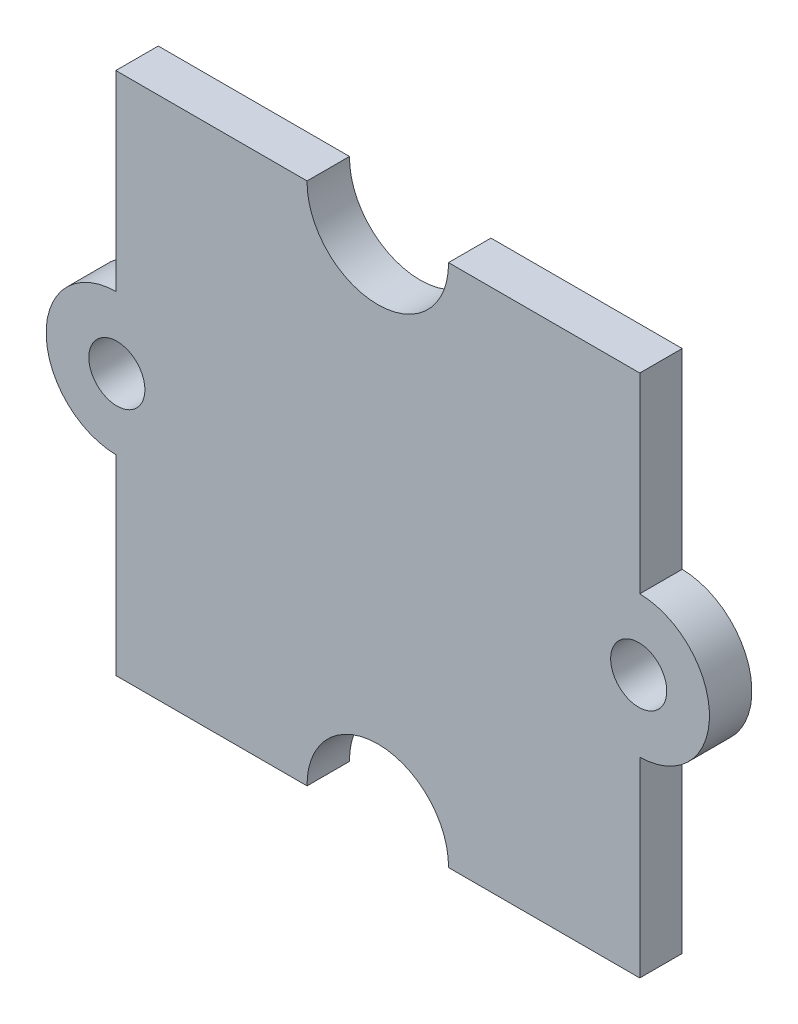
ISO-10303-21;
HEADER;
FILE_DESCRIPTION(('STEP AP214'),'2;1');
FILE_NAME('part.step','',(''),(''),'','','');
FILE_SCHEMA(('AUTOMOTIVE_DESIGN { 1 0 10303 214 1 1 1 1 }'));
ENDSEC;
DATA;
#1=APPLICATION_CONTEXT('core data for automotive mechanical design processes');
#2=APPLICATION_PROTOCOL_DEFINITION('international standard','automotive_design',2000,#1);
#3=PRODUCT_CONTEXT('',#1,'mechanical');
#4=PRODUCT('Part','Part','',(#3));
#5=PRODUCT_RELATED_PRODUCT_CATEGORY('part','',(#4));
#6=PRODUCT_DEFINITION_FORMATION('','',#4);
#7=PRODUCT_DEFINITION_CONTEXT('part definition',#1,'design');
#8=PRODUCT_DEFINITION('design','',#6,#7);
#9=PRODUCT_DEFINITION_SHAPE('','',#8);
#10=(LENGTH_UNIT() NAMED_UNIT(*) SI_UNIT(.MILLI.,.METRE.));
#11=(NAMED_UNIT(*) PLANE_ANGLE_UNIT() SI_UNIT($,.RADIAN.));
#12=(NAMED_UNIT(*) SI_UNIT($,.STERADIAN.) SOLID_ANGLE_UNIT());
#13=UNCERTAINTY_MEASURE_WITH_UNIT(LENGTH_MEASURE(1.E-05),#10,'distance_accuracy_value','');
#14=(GEOMETRIC_REPRESENTATION_CONTEXT(3) GLOBAL_UNCERTAINTY_ASSIGNED_CONTEXT((#13)) GLOBAL_UNIT_ASSIGNED_CONTEXT((#10,
#11,#12)) REPRESENTATION_CONTEXT('',''));
#15=CARTESIAN_POINT('',(0.,0.,0.));
#16=DIRECTION('',(0.,0.,1.));
#17=DIRECTION('',(1.,0.,0.));
#18=AXIS2_PLACEMENT_3D('',#15,#16,#17);
#19=CARTESIAN_POINT('',(-9.96,0.,1.62));
#20=DIRECTION('',(0.,0.,1.));
#21=DIRECTION('',(1.,0.,0.));
#22=AXIS2_PLACEMENT_3D('',#19,#20,#21);
#23=PLANE('',#22);
#24=CARTESIAN_POINT('',(-9.96,0.,1.62));
#25=DIRECTION('',(0.,0.,1.));
#26=DIRECTION('',(1.,0.,0.));
#27=AXIS2_PLACEMENT_3D('',#24,#25,#26);
#28=CIRCLE('',#27,1.07);
#29=CARTESIAN_POINT('',(-8.89,0.,1.62));
#30=VERTEX_POINT('',#29);
#31=EDGE_CURVE('E159',#30,#30,#28,.T.);
#32=ORIENTED_EDGE('',*,*,#31,.F.);
#33=EDGE_LOOP('',(#32));
#34=FACE_BOUND('',#33,.T.);
#35=DIRECTION('',(0.,-1.,0.));
#36=VECTOR('',#35,1.);
#37=CARTESIAN_POINT('',(-10.,10.,1.62));
#38=LINE('',#37,#36);
#39=CARTESIAN_POINT('',(-10.,10.,1.62));
#40=VERTEX_POINT('',#39);
#41=CARTESIAN_POINT('',(-10.,2.69970368744424,1.62));
#42=VERTEX_POINT('',#41);
#43=EDGE_CURVE('E178',#40,#42,#38,.T.);
#44=ORIENTED_EDGE('',*,*,#43,.T.);
#45=CARTESIAN_POINT('',(-9.96,0.,1.62));
#46=DIRECTION('',(0.,0.,1.));
#47=DIRECTION('',(1.,0.,0.));
#48=AXIS2_PLACEMENT_3D('',#45,#46,#47);
#49=CIRCLE('',#48,2.7);
#50=CARTESIAN_POINT('',(-10.,-2.69970368744424,1.62));
#51=VERTEX_POINT('',#50);
#52=EDGE_CURVE('E106',#42,#51,#49,.T.);
#53=ORIENTED_EDGE('',*,*,#52,.T.);
#54=DIRECTION('',(0.,-1.,0.));
#55=VECTOR('',#54,1.);
#56=CARTESIAN_POINT('',(-10.,-2.69970368744424,1.62));
#57=LINE('',#56,#55);
#58=CARTESIAN_POINT('',(-10.,-10.,1.62));
#59=VERTEX_POINT('',#58);
#60=EDGE_CURVE('E205',#51,#59,#57,.T.);
#61=ORIENTED_EDGE('',*,*,#60,.T.);
#62=DIRECTION('',(1.,0.,0.));
#63=VECTOR('',#62,1.);
#64=CARTESIAN_POINT('',(-10.,-10.,1.62));
#65=LINE('',#64,#63);
#66=CARTESIAN_POINT('',(-2.69970368744423,-10.,1.62));
#67=VERTEX_POINT('',#66);
#68=EDGE_CURVE('E224',#59,#67,#65,.T.);
#69=ORIENTED_EDGE('',*,*,#68,.T.);
#70=CARTESIAN_POINT('',(0.,-9.96,1.62));
#71=DIRECTION('',(0.,0.,-1.));
#72=DIRECTION('',(1.,0.,0.));
#73=AXIS2_PLACEMENT_3D('',#70,#71,#72);
#74=CIRCLE('',#73,2.7);
#75=CARTESIAN_POINT('',(2.69970368744424,-10.,1.62));
#76=VERTEX_POINT('',#75);
#77=EDGE_CURVE('E221',#67,#76,#74,.T.);
#78=ORIENTED_EDGE('',*,*,#77,.T.);
#79=DIRECTION('',(1.,0.,0.));
#80=VECTOR('',#79,1.);
#81=CARTESIAN_POINT('',(2.69970368744424,-10.,1.62));
#82=LINE('',#81,#80);
#83=CARTESIAN_POINT('',(10.,-10.,1.62));
#84=VERTEX_POINT('',#83);
#85=EDGE_CURVE('E223',#76,#84,#82,.T.);
#86=ORIENTED_EDGE('',*,*,#85,.T.);
#87=DIRECTION('',(0.,1.,0.));
#88=VECTOR('',#87,1.);
#89=CARTESIAN_POINT('',(10.,-2.69970368744423,1.62));
#90=LINE('',#89,#88);
#91=CARTESIAN_POINT('',(10.,-2.69970368744423,1.62));
#92=VERTEX_POINT('',#91);
#93=EDGE_CURVE('E226',#84,#92,#90,.T.);
#94=ORIENTED_EDGE('',*,*,#93,.T.);
#95=CARTESIAN_POINT('',(9.96,0.,1.62));
#96=DIRECTION('',(0.,0.,1.));
#97=DIRECTION('',(1.,0.,0.));
#98=AXIS2_PLACEMENT_3D('',#95,#96,#97);
#99=CIRCLE('',#98,2.7);
#100=CARTESIAN_POINT('',(10.,2.69970368744423,1.62));
#101=VERTEX_POINT('',#100);
#102=EDGE_CURVE('E232',#92,#101,#99,.T.);
#103=ORIENTED_EDGE('',*,*,#102,.T.);
#104=DIRECTION('',(0.,1.,0.));
#105=VECTOR('',#104,1.);
#106=CARTESIAN_POINT('',(10.,10.,1.62));
#107=LINE('',#106,#105);
#108=CARTESIAN_POINT('',(10.,10.,1.62));
#109=VERTEX_POINT('',#108);
#110=EDGE_CURVE('E137',#101,#109,#107,.T.);
#111=ORIENTED_EDGE('',*,*,#110,.T.);
#112=DIRECTION('',(-1.,0.,0.));
#113=VECTOR('',#112,1.);
#114=CARTESIAN_POINT('',(2.69970368744424,10.,1.62));
#115=LINE('',#114,#113);
#116=CARTESIAN_POINT('',(2.69970368744424,10.,1.62));
#117=VERTEX_POINT('',#116);
#118=EDGE_CURVE('E131',#109,#117,#115,.T.);
#119=ORIENTED_EDGE('',*,*,#118,.T.);
#120=CARTESIAN_POINT('',(0.,9.96,1.62));
#121=DIRECTION('',(0.,0.,-1.));
#122=DIRECTION('',(1.,0.,0.));
#123=AXIS2_PLACEMENT_3D('',#120,#121,#122);
#124=CIRCLE('',#123,2.7);
#125=CARTESIAN_POINT('',(-2.69970368744423,10.,1.62));
#126=VERTEX_POINT('',#125);
#127=EDGE_CURVE('E135',#117,#126,#124,.T.);
#128=ORIENTED_EDGE('',*,*,#127,.T.);
#129=DIRECTION('',(-1.,0.,0.));
#130=VECTOR('',#129,1.);
#131=CARTESIAN_POINT('',(-10.,10.,1.62));
#132=LINE('',#131,#130);
#133=EDGE_CURVE('E51',#126,#40,#132,.T.);
#134=ORIENTED_EDGE('',*,*,#133,.T.);
#135=EDGE_LOOP('',(#44,#53,#61,#69,#78,#86,#94,#103,#111,#119,#128,#134));
#136=FACE_BOUND('',#135,.T.);
#137=CARTESIAN_POINT('',(9.96,0.,1.62));
#138=DIRECTION('',(0.,0.,1.));
#139=DIRECTION('',(1.,0.,0.));
#140=AXIS2_PLACEMENT_3D('',#137,#138,#139);
#141=CIRCLE('',#140,1.07);
#142=CARTESIAN_POINT('',(11.03,0.,1.62));
#143=VERTEX_POINT('',#142);
#144=EDGE_CURVE('E274',#143,#143,#141,.T.);
#145=ORIENTED_EDGE('',*,*,#144,.F.);
#146=EDGE_LOOP('',(#145));
#147=FACE_BOUND('',#146,.T.);
#148=ADVANCED_FACE('F34',(#34,#136,#147),#23,.T.);
#149=CARTESIAN_POINT('',(-9.96,0.,0.));
#150=DIRECTION('',(0.,0.,1.));
#151=DIRECTION('',(1.,0.,0.));
#152=AXIS2_PLACEMENT_3D('',#149,#150,#151);
#153=PLANE('',#152);
#154=DIRECTION('',(0.,-1.,0.));
#155=VECTOR('',#154,1.);
#156=CARTESIAN_POINT('',(-10.,10.,0.));
#157=LINE('',#156,#155);
#158=CARTESIAN_POINT('',(-10.,10.,0.));
#159=VERTEX_POINT('',#158);
#160=CARTESIAN_POINT('',(-10.,2.69970368744424,0.));
#161=VERTEX_POINT('',#160);
#162=EDGE_CURVE('E155',#159,#161,#157,.T.);
#163=ORIENTED_EDGE('',*,*,#162,.F.);
#164=DIRECTION('',(-1.,0.,0.));
#165=VECTOR('',#164,1.);
#166=CARTESIAN_POINT('',(-10.,10.,0.));
#167=LINE('',#166,#165);
#168=CARTESIAN_POINT('',(-2.69970368744423,10.,0.));
#169=VERTEX_POINT('',#168);
#170=EDGE_CURVE('E98',#169,#159,#167,.T.);
#171=ORIENTED_EDGE('',*,*,#170,.F.);
#172=CARTESIAN_POINT('',(0.,9.96,0.));
#173=DIRECTION('',(0.,0.,-1.));
#174=DIRECTION('',(1.,0.,0.));
#175=AXIS2_PLACEMENT_3D('',#172,#173,#174);
#176=CIRCLE('',#175,2.7);
#177=CARTESIAN_POINT('',(2.69970368744424,10.,0.));
#178=VERTEX_POINT('',#177);
#179=EDGE_CURVE('E92',#178,#169,#176,.T.);
#180=ORIENTED_EDGE('',*,*,#179,.F.);
#181=DIRECTION('',(-1.,0.,0.));
#182=VECTOR('',#181,1.);
#183=CARTESIAN_POINT('',(2.69970368744424,10.,0.));
#184=LINE('',#183,#182);
#185=CARTESIAN_POINT('',(10.,10.,0.));
#186=VERTEX_POINT('',#185);
#187=EDGE_CURVE('E145',#186,#178,#184,.T.);
#188=ORIENTED_EDGE('',*,*,#187,.F.);
#189=DIRECTION('',(0.,1.,0.));
#190=VECTOR('',#189,1.);
#191=CARTESIAN_POINT('',(10.,10.,0.));
#192=LINE('',#191,#190);
#193=CARTESIAN_POINT('',(10.,2.69970368744423,0.));
#194=VERTEX_POINT('',#193);
#195=EDGE_CURVE('E173',#194,#186,#192,.T.);
#196=ORIENTED_EDGE('',*,*,#195,.F.);
#197=CARTESIAN_POINT('',(9.96,0.,0.));
#198=DIRECTION('',(0.,0.,1.));
#199=DIRECTION('',(1.,0.,0.));
#200=AXIS2_PLACEMENT_3D('',#197,#198,#199);
#201=CIRCLE('',#200,2.7);
#202=CARTESIAN_POINT('',(10.,-2.69970368744423,0.));
#203=VERTEX_POINT('',#202);
#204=EDGE_CURVE('E171',#203,#194,#201,.T.);
#205=ORIENTED_EDGE('',*,*,#204,.F.);
#206=DIRECTION('',(0.,1.,0.));
#207=VECTOR('',#206,1.);
#208=CARTESIAN_POINT('',(10.,-2.69970368744423,0.));
#209=LINE('',#208,#207);
#210=CARTESIAN_POINT('',(10.,-10.,0.));
#211=VERTEX_POINT('',#210);
#212=EDGE_CURVE('E169',#211,#203,#209,.T.);
#213=ORIENTED_EDGE('',*,*,#212,.F.);
#214=DIRECTION('',(1.,0.,0.));
#215=VECTOR('',#214,1.);
#216=CARTESIAN_POINT('',(2.69970368744424,-10.,0.));
#217=LINE('',#216,#215);
#218=CARTESIAN_POINT('',(2.69970368744424,-10.,0.));
#219=VERTEX_POINT('',#218);
#220=EDGE_CURVE('E167',#219,#211,#217,.T.);
#221=ORIENTED_EDGE('',*,*,#220,.F.);
#222=CARTESIAN_POINT('',(0.,-9.96,0.));
#223=DIRECTION('',(0.,0.,-1.));
#224=DIRECTION('',(1.,0.,0.));
#225=AXIS2_PLACEMENT_3D('',#222,#223,#224);
#226=CIRCLE('',#225,2.7);
#227=CARTESIAN_POINT('',(-2.69970368744423,-10.,0.));
#228=VERTEX_POINT('',#227);
#229=EDGE_CURVE('E165',#228,#219,#226,.T.);
#230=ORIENTED_EDGE('',*,*,#229,.F.);
#231=DIRECTION('',(1.,0.,0.));
#232=VECTOR('',#231,1.);
#233=CARTESIAN_POINT('',(-10.,-10.,0.));
#234=LINE('',#233,#232);
#235=CARTESIAN_POINT('',(-10.,-10.,0.));
#236=VERTEX_POINT('',#235);
#237=EDGE_CURVE('E163',#236,#228,#234,.T.);
#238=ORIENTED_EDGE('',*,*,#237,.F.);
#239=DIRECTION('',(0.,-1.,0.));
#240=VECTOR('',#239,1.);
#241=CARTESIAN_POINT('',(-10.,-2.69970368744424,0.));
#242=LINE('',#241,#240);
#243=CARTESIAN_POINT('',(-10.,-2.69970368744424,0.));
#244=VERTEX_POINT('',#243);
#245=EDGE_CURVE('E161',#244,#236,#242,.T.);
#246=ORIENTED_EDGE('',*,*,#245,.F.);
#247=CARTESIAN_POINT('',(-9.96,0.,0.));
#248=DIRECTION('',(0.,0.,1.));
#249=DIRECTION('',(1.,0.,0.));
#250=AXIS2_PLACEMENT_3D('',#247,#248,#249);
#251=CIRCLE('',#250,2.7);
#252=EDGE_CURVE('E158',#161,#244,#251,.T.);
#253=ORIENTED_EDGE('',*,*,#252,.F.);
#254=EDGE_LOOP('',(#163,#171,#180,#188,#196,#205,#213,#221,#230,#238,#246,#253));
#255=FACE_BOUND('',#254,.T.);
#256=CARTESIAN_POINT('',(-9.96,0.,0.));
#257=DIRECTION('',(0.,0.,1.));
#258=DIRECTION('',(1.,0.,0.));
#259=AXIS2_PLACEMENT_3D('',#256,#257,#258);
#260=CIRCLE('',#259,1.07);
#261=CARTESIAN_POINT('',(-8.89,0.,0.));
#262=VERTEX_POINT('',#261);
#263=EDGE_CURVE('E280',#262,#262,#260,.T.);
#264=ORIENTED_EDGE('',*,*,#263,.T.);
#265=EDGE_LOOP('',(#264));
#266=FACE_BOUND('',#265,.T.);
#267=CARTESIAN_POINT('',(9.96,0.,0.));
#268=DIRECTION('',(0.,0.,1.));
#269=DIRECTION('',(1.,0.,0.));
#270=AXIS2_PLACEMENT_3D('',#267,#268,#269);
#271=CIRCLE('',#270,1.07);
#272=CARTESIAN_POINT('',(11.03,0.,0.));
#273=VERTEX_POINT('',#272);
#274=EDGE_CURVE('E277',#273,#273,#271,.T.);
#275=ORIENTED_EDGE('',*,*,#274,.T.);
#276=EDGE_LOOP('',(#275));
#277=FACE_BOUND('',#276,.T.);
#278=ADVANCED_FACE('F209',(#255,#266,#277),#153,.F.);
#279=CARTESIAN_POINT('',(-10.,10.,1.62));
#280=DIRECTION('',(1.,0.,0.));
#281=DIRECTION('',(0.,1.,0.));
#282=AXIS2_PLACEMENT_3D('',#279,#280,#281);
#283=PLANE('',#282);
#284=ORIENTED_EDGE('',*,*,#162,.T.);
#285=DIRECTION('',(0.,0.,-1.));
#286=VECTOR('',#285,1.);
#287=CARTESIAN_POINT('',(-10.,2.69970368744424,1.62));
#288=LINE('',#287,#286);
#289=EDGE_CURVE('E11',#42,#161,#288,.T.);
#290=ORIENTED_EDGE('',*,*,#289,.F.);
#291=ORIENTED_EDGE('',*,*,#43,.F.);
#292=DIRECTION('',(0.,0.,-1.));
#293=VECTOR('',#292,1.);
#294=CARTESIAN_POINT('',(-10.,10.,1.62));
#295=LINE('',#294,#293);
#296=EDGE_CURVE('E151',#40,#159,#295,.T.);
#297=ORIENTED_EDGE('',*,*,#296,.T.);
#298=EDGE_LOOP('',(#284,#290,#291,#297));
#299=FACE_BOUND('',#298,.T.);
#300=ADVANCED_FACE('F36',(#299),#283,.F.);
#301=CARTESIAN_POINT('',(-9.96,0.,1.62));
#302=DIRECTION('',(0.,0.,-1.));
#303=DIRECTION('',(-1.,0.,0.));
#304=AXIS2_PLACEMENT_3D('',#301,#302,#303);
#305=CYLINDRICAL_SURFACE('',#304,2.7);
#306=ORIENTED_EDGE('',*,*,#252,.T.);
#307=DIRECTION('',(0.,0.,-1.));
#308=VECTOR('',#307,1.);
#309=CARTESIAN_POINT('',(-10.,-2.69970368744424,1.62));
#310=LINE('',#309,#308);
#311=EDGE_CURVE('E43',#51,#244,#310,.T.);
#312=ORIENTED_EDGE('',*,*,#311,.F.);
#313=ORIENTED_EDGE('',*,*,#52,.F.);
#314=ORIENTED_EDGE('',*,*,#289,.T.);
#315=EDGE_LOOP('',(#306,#312,#313,#314));
#316=FACE_BOUND('',#315,.T.);
#317=ADVANCED_FACE('F373',(#316),#305,.T.);
#318=CARTESIAN_POINT('',(-10.,-2.69970368744424,1.62));
#319=DIRECTION('',(1.,0.,0.));
#320=DIRECTION('',(0.,1.,0.));
#321=AXIS2_PLACEMENT_3D('',#318,#319,#320);
#322=PLANE('',#321);
#323=ORIENTED_EDGE('',*,*,#245,.T.);
#324=DIRECTION('',(0.,0.,-1.));
#325=VECTOR('',#324,1.);
#326=CARTESIAN_POINT('',(-10.,-10.,1.62));
#327=LINE('',#326,#325);
#328=EDGE_CURVE('E197',#59,#236,#327,.T.);
#329=ORIENTED_EDGE('',*,*,#328,.F.);
#330=ORIENTED_EDGE('',*,*,#60,.F.);
#331=ORIENTED_EDGE('',*,*,#311,.T.);
#332=EDGE_LOOP('',(#323,#329,#330,#331));
#333=FACE_BOUND('',#332,.T.);
#334=ADVANCED_FACE('F203',(#333),#322,.F.);
#335=CARTESIAN_POINT('',(-10.,-10.,1.62));
#336=DIRECTION('',(0.,1.,0.));
#337=DIRECTION('',(0.,0.,1.));
#338=AXIS2_PLACEMENT_3D('',#335,#336,#337);
#339=PLANE('',#338);
#340=ORIENTED_EDGE('',*,*,#237,.T.);
#341=DIRECTION('',(0.,0.,-1.));
#342=VECTOR('',#341,1.);
#343=CARTESIAN_POINT('',(-2.69970368744423,-10.,1.62));
#344=LINE('',#343,#342);
#345=EDGE_CURVE('E194',#67,#228,#344,.T.);
#346=ORIENTED_EDGE('',*,*,#345,.F.);
#347=ORIENTED_EDGE('',*,*,#68,.F.);
#348=ORIENTED_EDGE('',*,*,#328,.T.);
#349=EDGE_LOOP('',(#340,#346,#347,#348));
#350=FACE_BOUND('',#349,.T.);
#351=ADVANCED_FACE('F215',(#350),#339,.F.);
#352=CARTESIAN_POINT('',(0.,-9.96,1.62));
#353=DIRECTION('',(0.,0.,-1.));
#354=DIRECTION('',(-1.,0.,0.));
#355=AXIS2_PLACEMENT_3D('',#352,#353,#354);
#356=CYLINDRICAL_SURFACE('',#355,2.7);
#357=ORIENTED_EDGE('',*,*,#229,.T.);
#358=DIRECTION('',(0.,0.,-1.));
#359=VECTOR('',#358,1.);
#360=CARTESIAN_POINT('',(2.69970368744424,-10.,1.62));
#361=LINE('',#360,#359);
#362=EDGE_CURVE('E191',#76,#219,#361,.T.);
#363=ORIENTED_EDGE('',*,*,#362,.F.);
#364=ORIENTED_EDGE('',*,*,#77,.F.);
#365=ORIENTED_EDGE('',*,*,#345,.T.);
#366=EDGE_LOOP('',(#357,#363,#364,#365));
#367=FACE_BOUND('',#366,.T.);
#368=ADVANCED_FACE('F219',(#367),#356,.F.);
#369=CARTESIAN_POINT('',(2.69970368744424,-10.,1.62));
#370=DIRECTION('',(0.,1.,0.));
#371=DIRECTION('',(0.,0.,1.));
#372=AXIS2_PLACEMENT_3D('',#369,#370,#371);
#373=PLANE('',#372);
#374=ORIENTED_EDGE('',*,*,#220,.T.);
#375=DIRECTION('',(0.,0.,-1.));
#376=VECTOR('',#375,1.);
#377=CARTESIAN_POINT('',(10.,-10.,1.62));
#378=LINE('',#377,#376);
#379=EDGE_CURVE('E188',#84,#211,#378,.T.);
#380=ORIENTED_EDGE('',*,*,#379,.F.);
#381=ORIENTED_EDGE('',*,*,#85,.F.);
#382=ORIENTED_EDGE('',*,*,#362,.T.);
#383=EDGE_LOOP('',(#374,#380,#381,#382));
#384=FACE_BOUND('',#383,.T.);
#385=ADVANCED_FACE('F338',(#384),#373,.F.);
#386=CARTESIAN_POINT('',(10.,-2.69970368744423,1.62));
#387=DIRECTION('',(-1.,0.,0.));
#388=DIRECTION('',(0.,-1.,0.));
#389=AXIS2_PLACEMENT_3D('',#386,#387,#388);
#390=PLANE('',#389);
#391=ORIENTED_EDGE('',*,*,#212,.T.);
#392=DIRECTION('',(0.,0.,-1.));
#393=VECTOR('',#392,1.);
#394=CARTESIAN_POINT('',(10.,-2.69970368744423,1.62));
#395=LINE('',#394,#393);
#396=EDGE_CURVE('E185',#92,#203,#395,.T.);
#397=ORIENTED_EDGE('',*,*,#396,.F.);
#398=ORIENTED_EDGE('',*,*,#93,.F.);
#399=ORIENTED_EDGE('',*,*,#379,.T.);
#400=EDGE_LOOP('',(#391,#397,#398,#399));
#401=FACE_BOUND('',#400,.T.);
#402=ADVANCED_FACE('F329',(#401),#390,.F.);
#403=CARTESIAN_POINT('',(9.96,0.,1.62));
#404=DIRECTION('',(0.,0.,-1.));
#405=DIRECTION('',(-1.,0.,0.));
#406=AXIS2_PLACEMENT_3D('',#403,#404,#405);
#407=CYLINDRICAL_SURFACE('',#406,2.7);
#408=ORIENTED_EDGE('',*,*,#204,.T.);
#409=DIRECTION('',(0.,0.,-1.));
#410=VECTOR('',#409,1.);
#411=CARTESIAN_POINT('',(10.,2.69970368744423,1.62));
#412=LINE('',#411,#410);
#413=EDGE_CURVE('E182',#101,#194,#412,.T.);
#414=ORIENTED_EDGE('',*,*,#413,.F.);
#415=ORIENTED_EDGE('',*,*,#102,.F.);
#416=ORIENTED_EDGE('',*,*,#396,.T.);
#417=EDGE_LOOP('',(#408,#414,#415,#416));
#418=FACE_BOUND('',#417,.T.);
#419=ADVANCED_FACE('F238',(#418),#407,.T.);
#420=CARTESIAN_POINT('',(10.,10.,1.62));
#421=DIRECTION('',(-1.,0.,0.));
#422=DIRECTION('',(0.,-1.,0.));
#423=AXIS2_PLACEMENT_3D('',#420,#421,#422);
#424=PLANE('',#423);
#425=ORIENTED_EDGE('',*,*,#195,.T.);
#426=DIRECTION('',(0.,0.,-1.));
#427=VECTOR('',#426,1.);
#428=CARTESIAN_POINT('',(10.,10.,1.62));
#429=LINE('',#428,#427);
#430=EDGE_CURVE('E146',#109,#186,#429,.T.);
#431=ORIENTED_EDGE('',*,*,#430,.F.);
#432=ORIENTED_EDGE('',*,*,#110,.F.);
#433=ORIENTED_EDGE('',*,*,#413,.T.);
#434=EDGE_LOOP('',(#425,#431,#432,#433));
#435=FACE_BOUND('',#434,.T.);
#436=ADVANCED_FACE('F242',(#435),#424,.F.);
#437=CARTESIAN_POINT('',(2.69970368744424,10.,1.62));
#438=DIRECTION('',(0.,-1.,0.));
#439=DIRECTION('',(0.,0.,-1.));
#440=AXIS2_PLACEMENT_3D('',#437,#438,#439);
#441=PLANE('',#440);
#442=ORIENTED_EDGE('',*,*,#187,.T.);
#443=DIRECTION('',(0.,0.,-1.));
#444=VECTOR('',#443,1.);
#445=CARTESIAN_POINT('',(2.69970368744424,10.,1.62));
#446=LINE('',#445,#444);
#447=EDGE_CURVE('E142',#117,#178,#446,.T.);
#448=ORIENTED_EDGE('',*,*,#447,.F.);
#449=ORIENTED_EDGE('',*,*,#118,.F.);
#450=ORIENTED_EDGE('',*,*,#430,.T.);
#451=EDGE_LOOP('',(#442,#448,#449,#450));
#452=FACE_BOUND('',#451,.T.);
#453=ADVANCED_FACE('F143',(#452),#441,.F.);
#454=CARTESIAN_POINT('',(0.,9.96,1.62));
#455=DIRECTION('',(0.,0.,-1.));
#456=DIRECTION('',(-1.,0.,0.));
#457=AXIS2_PLACEMENT_3D('',#454,#455,#456);
#458=CYLINDRICAL_SURFACE('',#457,2.7);
#459=ORIENTED_EDGE('',*,*,#179,.T.);
#460=DIRECTION('',(0.,0.,-1.));
#461=VECTOR('',#460,1.);
#462=CARTESIAN_POINT('',(-2.69970368744423,10.,1.62));
#463=LINE('',#462,#461);
#464=EDGE_CURVE('E147',#126,#169,#463,.T.);
#465=ORIENTED_EDGE('',*,*,#464,.F.);
#466=ORIENTED_EDGE('',*,*,#127,.F.);
#467=ORIENTED_EDGE('',*,*,#447,.T.);
#468=EDGE_LOOP('',(#459,#465,#466,#467));
#469=FACE_BOUND('',#468,.T.);
#470=ADVANCED_FACE('F149',(#469),#458,.F.);
#471=CARTESIAN_POINT('',(-10.,10.,1.62));
#472=DIRECTION('',(0.,-1.,0.));
#473=DIRECTION('',(1.,0.,0.));
#474=AXIS2_PLACEMENT_3D('',#471,#472,#473);
#475=PLANE('',#474);
#476=ORIENTED_EDGE('',*,*,#170,.T.);
#477=ORIENTED_EDGE('',*,*,#296,.F.);
#478=ORIENTED_EDGE('',*,*,#133,.F.);
#479=ORIENTED_EDGE('',*,*,#464,.T.);
#480=EDGE_LOOP('',(#476,#477,#478,#479));
#481=FACE_BOUND('',#480,.T.);
#482=ADVANCED_FACE('F246',(#481),#475,.F.);
#483=CARTESIAN_POINT('',(-9.96,0.,1.62));
#484=DIRECTION('',(0.,0.,-1.));
#485=DIRECTION('',(-1.,0.,0.));
#486=AXIS2_PLACEMENT_3D('',#483,#484,#485);
#487=CYLINDRICAL_SURFACE('',#486,1.07);
#488=ORIENTED_EDGE('',*,*,#31,.T.);
#489=EDGE_LOOP('',(#488));
#490=FACE_BOUND('',#489,.T.);
#491=ORIENTED_EDGE('',*,*,#263,.F.);
#492=EDGE_LOOP('',(#491));
#493=FACE_BOUND('',#492,.T.);
#494=ADVANCED_FACE('F248',(#490,#493),#487,.F.);
#495=CARTESIAN_POINT('',(9.96,0.,1.62));
#496=DIRECTION('',(0.,0.,-1.));
#497=DIRECTION('',(-1.,0.,0.));
#498=AXIS2_PLACEMENT_3D('',#495,#496,#497);
#499=CYLINDRICAL_SURFACE('',#498,1.07);
#500=ORIENTED_EDGE('',*,*,#144,.T.);
#501=EDGE_LOOP('',(#500));
#502=FACE_BOUND('',#501,.T.);
#503=ORIENTED_EDGE('',*,*,#274,.F.);
#504=EDGE_LOOP('',(#503));
#505=FACE_BOUND('',#504,.T.);
#506=ADVANCED_FACE('F254',(#502,#505),#499,.F.);
#507=CLOSED_SHELL('',(#148,#278,#300,#317,#334,#351,#368,#385,#402,#419,#436,#453,#470,#482,
#494,#506));
#508=MANIFOLD_SOLID_BREP('B2',#507);
#509=ADVANCED_BREP_SHAPE_REPRESENTATION('',(#18,#508),#14);
#510=SHAPE_DEFINITION_REPRESENTATION(#9,#509);
ENDSEC;
END-ISO-10303-21;
